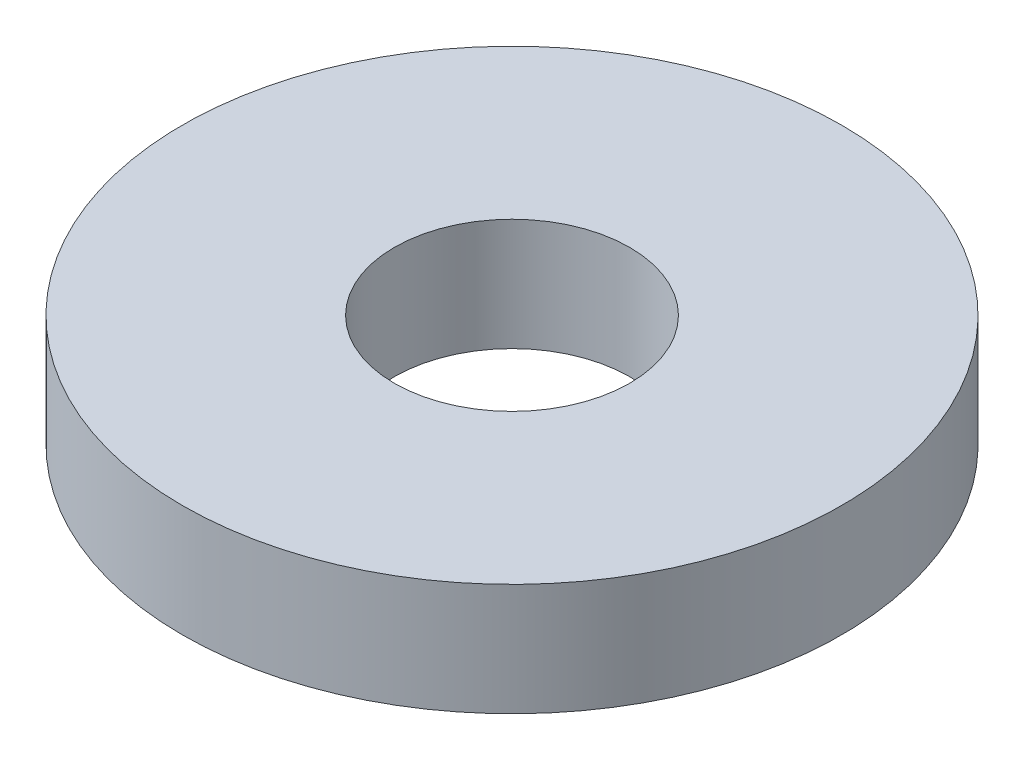
ISO-10303-21;
HEADER;
FILE_DESCRIPTION(('STEP AP214'),'2;1');
FILE_NAME('part.step','',(''),(''),'','','');
FILE_SCHEMA(('AUTOMOTIVE_DESIGN { 1 0 10303 214 1 1 1 1 }'));
ENDSEC;
DATA;
#1=APPLICATION_CONTEXT('core data for automotive mechanical design processes');
#2=APPLICATION_PROTOCOL_DEFINITION('international standard','automotive_design',2000,#1);
#3=PRODUCT_CONTEXT('',#1,'mechanical');
#4=PRODUCT('Part','Part','',(#3));
#5=PRODUCT_RELATED_PRODUCT_CATEGORY('part','',(#4));
#6=PRODUCT_DEFINITION_FORMATION('','',#4);
#7=PRODUCT_DEFINITION_CONTEXT('part definition',#1,'design');
#8=PRODUCT_DEFINITION('design','',#6,#7);
#9=PRODUCT_DEFINITION_SHAPE('','',#8);
#10=(LENGTH_UNIT() NAMED_UNIT(*) SI_UNIT(.MILLI.,.METRE.));
#11=(NAMED_UNIT(*) PLANE_ANGLE_UNIT() SI_UNIT($,.RADIAN.));
#12=(NAMED_UNIT(*) SI_UNIT($,.STERADIAN.) SOLID_ANGLE_UNIT());
#13=UNCERTAINTY_MEASURE_WITH_UNIT(LENGTH_MEASURE(1.E-05),#10,'distance_accuracy_value','');
#14=(GEOMETRIC_REPRESENTATION_CONTEXT(3) GLOBAL_UNCERTAINTY_ASSIGNED_CONTEXT((#13)) GLOBAL_UNIT_ASSIGNED_CONTEXT((#10,
#11,#12)) REPRESENTATION_CONTEXT('',''));
#15=CARTESIAN_POINT('',(0.,0.,0.));
#16=DIRECTION('',(0.,0.,1.));
#17=DIRECTION('',(1.,0.,0.));
#18=AXIS2_PLACEMENT_3D('',#15,#16,#17);
#19=CARTESIAN_POINT('',(0.,11.9,0.));
#20=DIRECTION('',(0.,1.,0.));
#21=DIRECTION('',(0.,0.,1.));
#22=AXIS2_PLACEMENT_3D('',#19,#20,#21);
#23=PLANE('',#22);
#24=CARTESIAN_POINT('',(0.,11.9,0.));
#25=DIRECTION('',(0.,1.,0.));
#26=DIRECTION('',(0.,0.,1.));
#27=AXIS2_PLACEMENT_3D('',#24,#25,#26);
#28=CIRCLE('',#27,35.);
#29=CARTESIAN_POINT('',(0.,11.9,35.));
#30=VERTEX_POINT('',#29);
#31=EDGE_CURVE('E10',#30,#30,#28,.T.);
#32=ORIENTED_EDGE('',*,*,#31,.T.);
#33=EDGE_LOOP('',(#32));
#34=FACE_BOUND('',#33,.T.);
#35=CARTESIAN_POINT('',(0.,11.9,0.));
#36=DIRECTION('',(0.,1.,0.));
#37=DIRECTION('',(0.,0.,1.));
#38=AXIS2_PLACEMENT_3D('',#35,#36,#37);
#39=CIRCLE('',#38,12.5);
#40=CARTESIAN_POINT('',(0.,11.9,12.5));
#41=VERTEX_POINT('',#40);
#42=EDGE_CURVE('E56',#41,#41,#39,.T.);
#43=ORIENTED_EDGE('',*,*,#42,.F.);
#44=EDGE_LOOP('',(#43));
#45=FACE_BOUND('',#44,.T.);
#46=ADVANCED_FACE('F45',(#34,#45),#23,.T.);
#47=CARTESIAN_POINT('',(0.,0.,0.));
#48=DIRECTION('',(0.,1.,0.));
#49=DIRECTION('',(0.,0.,1.));
#50=AXIS2_PLACEMENT_3D('',#47,#48,#49);
#51=PLANE('',#50);
#52=CARTESIAN_POINT('',(0.,0.,0.));
#53=DIRECTION('',(0.,1.,0.));
#54=DIRECTION('',(0.,0.,1.));
#55=AXIS2_PLACEMENT_3D('',#52,#53,#54);
#56=CIRCLE('',#55,35.);
#57=CARTESIAN_POINT('',(0.,0.,35.));
#58=VERTEX_POINT('',#57);
#59=EDGE_CURVE('E49',#58,#58,#56,.T.);
#60=ORIENTED_EDGE('',*,*,#59,.F.);
#61=EDGE_LOOP('',(#60));
#62=FACE_BOUND('',#61,.T.);
#63=CARTESIAN_POINT('',(0.,0.,0.));
#64=DIRECTION('',(0.,1.,0.));
#65=DIRECTION('',(0.,0.,1.));
#66=AXIS2_PLACEMENT_3D('',#63,#64,#65);
#67=CIRCLE('',#66,12.5);
#68=CARTESIAN_POINT('',(0.,0.,12.5));
#69=VERTEX_POINT('',#68);
#70=EDGE_CURVE('E58',#69,#69,#67,.T.);
#71=ORIENTED_EDGE('',*,*,#70,.T.);
#72=EDGE_LOOP('',(#71));
#73=FACE_BOUND('',#72,.T.);
#74=ADVANCED_FACE('F68',(#62,#73),#51,.F.);
#75=CARTESIAN_POINT('',(0.,11.9,0.));
#76=DIRECTION('',(0.,-1.,0.));
#77=DIRECTION('',(0.,0.,-1.));
#78=AXIS2_PLACEMENT_3D('',#75,#76,#77);
#79=CYLINDRICAL_SURFACE('',#78,35.);
#80=ORIENTED_EDGE('',*,*,#31,.F.);
#81=EDGE_LOOP('',(#80));
#82=FACE_BOUND('',#81,.T.);
#83=ORIENTED_EDGE('',*,*,#59,.T.);
#84=EDGE_LOOP('',(#83));
#85=FACE_BOUND('',#84,.T.);
#86=ADVANCED_FACE('F47',(#82,#85),#79,.T.);
#87=CARTESIAN_POINT('',(0.,11.9,0.));
#88=DIRECTION('',(0.,-1.,0.));
#89=DIRECTION('',(0.,0.,-1.));
#90=AXIS2_PLACEMENT_3D('',#87,#88,#89);
#91=CYLINDRICAL_SURFACE('',#90,12.5);
#92=ORIENTED_EDGE('',*,*,#42,.T.);
#93=EDGE_LOOP('',(#92));
#94=FACE_BOUND('',#93,.T.);
#95=ORIENTED_EDGE('',*,*,#70,.F.);
#96=EDGE_LOOP('',(#95));
#97=FACE_BOUND('',#96,.T.);
#98=ADVANCED_FACE('F64',(#94,#97),#91,.F.);
#99=CLOSED_SHELL('',(#46,#74,#86,#98));
#100=MANIFOLD_SOLID_BREP('B2',#99);
#101=ADVANCED_BREP_SHAPE_REPRESENTATION('',(#18,#100),#14);
#102=SHAPE_DEFINITION_REPRESENTATION(#9,#101);
ENDSEC;
END-ISO-10303-21;
